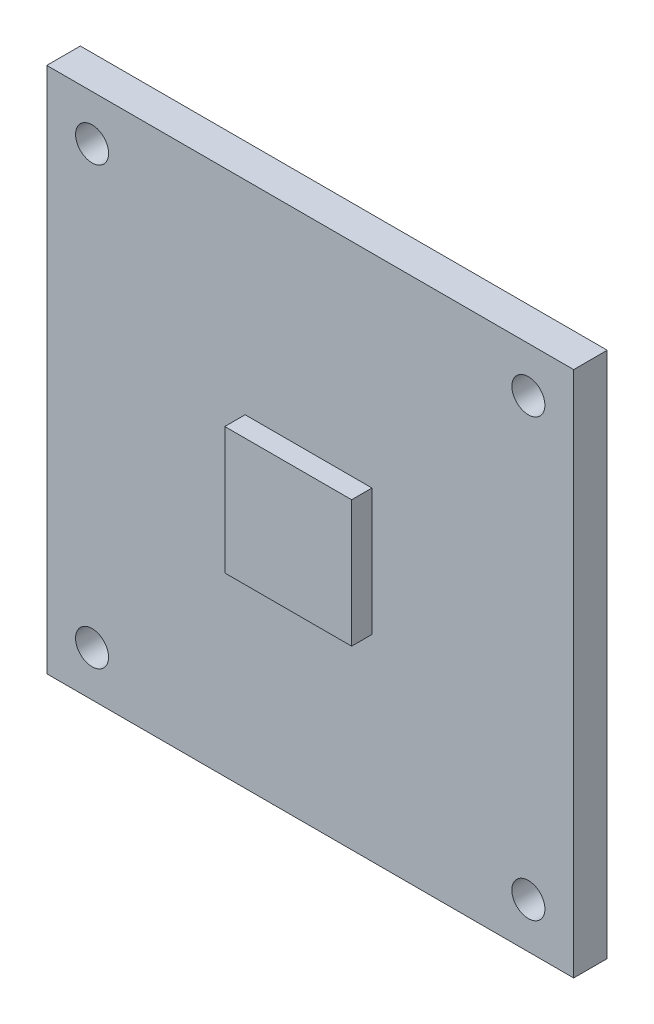
ISO-10303-21;
HEADER;
FILE_DESCRIPTION(('STEP AP214'),'2;1');
FILE_NAME('part.step','',(''),(''),'','','');
FILE_SCHEMA(('AUTOMOTIVE_DESIGN { 1 0 10303 214 1 1 1 1 }'));
ENDSEC;
DATA;
#1=APPLICATION_CONTEXT('core data for automotive mechanical design processes');
#2=APPLICATION_PROTOCOL_DEFINITION('international standard','automotive_design',2000,#1);
#3=PRODUCT_CONTEXT('',#1,'mechanical');
#4=PRODUCT('Part','Part','',(#3));
#5=PRODUCT_RELATED_PRODUCT_CATEGORY('part','',(#4));
#6=PRODUCT_DEFINITION_FORMATION('','',#4);
#7=PRODUCT_DEFINITION_CONTEXT('part definition',#1,'design');
#8=PRODUCT_DEFINITION('design','',#6,#7);
#9=PRODUCT_DEFINITION_SHAPE('','',#8);
#10=(LENGTH_UNIT() NAMED_UNIT(*) SI_UNIT(.MILLI.,.METRE.));
#11=(NAMED_UNIT(*) PLANE_ANGLE_UNIT() SI_UNIT($,.RADIAN.));
#12=(NAMED_UNIT(*) SI_UNIT($,.STERADIAN.) SOLID_ANGLE_UNIT());
#13=UNCERTAINTY_MEASURE_WITH_UNIT(LENGTH_MEASURE(1.E-05),#10,'distance_accuracy_value','');
#14=(GEOMETRIC_REPRESENTATION_CONTEXT(3) GLOBAL_UNCERTAINTY_ASSIGNED_CONTEXT((#13)) GLOBAL_UNIT_ASSIGNED_CONTEXT((#10,
#11,#12)) REPRESENTATION_CONTEXT('',''));
#15=CARTESIAN_POINT('',(0.,0.,0.));
#16=DIRECTION('',(0.,0.,1.));
#17=DIRECTION('',(1.,0.,0.));
#18=AXIS2_PLACEMENT_3D('',#15,#16,#17);
#19=CARTESIAN_POINT('',(0.,0.,0.));
#20=DIRECTION('',(0.,0.,1.));
#21=DIRECTION('',(1.,0.,0.));
#22=AXIS2_PLACEMENT_3D('',#19,#20,#21);
#23=PLANE('',#22);
#24=DIRECTION('',(0.,-1.,0.));
#25=VECTOR('',#24,1.);
#26=CARTESIAN_POINT('',(-3.42905,36.449,0.));
#27=LINE('',#26,#25);
#28=CARTESIAN_POINT('',(-3.42905,36.449,0.));
#29=VERTEX_POINT('',#28);
#30=CARTESIAN_POINT('',(-3.42905,-3.42905,0.));
#31=VERTEX_POINT('',#30);
#32=EDGE_CURVE('E164',#29,#31,#27,.T.);
#33=ORIENTED_EDGE('',*,*,#32,.T.);
#34=DIRECTION('',(1.,0.,0.));
#35=VECTOR('',#34,1.);
#36=CARTESIAN_POINT('',(-3.42905,-3.42905,0.));
#37=LINE('',#36,#35);
#38=CARTESIAN_POINT('',(36.449,-3.42905,0.));
#39=VERTEX_POINT('',#38);
#40=EDGE_CURVE('E177',#31,#39,#37,.T.);
#41=ORIENTED_EDGE('',*,*,#40,.T.);
#42=DIRECTION('',(0.,1.,0.));
#43=VECTOR('',#42,1.);
#44=CARTESIAN_POINT('',(36.449,36.449,0.));
#45=LINE('',#44,#43);
#46=CARTESIAN_POINT('',(36.449,36.449,0.));
#47=VERTEX_POINT('',#46);
#48=EDGE_CURVE('E180',#39,#47,#45,.T.);
#49=ORIENTED_EDGE('',*,*,#48,.T.);
#50=DIRECTION('',(-1.,0.,0.));
#51=VECTOR('',#50,1.);
#52=CARTESIAN_POINT('',(-3.42905,36.449,0.));
#53=LINE('',#52,#51);
#54=EDGE_CURVE('E168',#47,#29,#53,.T.);
#55=ORIENTED_EDGE('',*,*,#54,.T.);
#56=EDGE_LOOP('',(#33,#41,#49,#55));
#57=FACE_BOUND('',#56,.T.);
#58=CARTESIAN_POINT('',(0.,0.,0.));
#59=DIRECTION('',(0.,0.,1.));
#60=DIRECTION('',(1.,0.,0.));
#61=AXIS2_PLACEMENT_3D('',#58,#59,#60);
#62=CIRCLE('',#61,1.24999999999999);
#63=CARTESIAN_POINT('',(1.24999999999999,0.,0.));
#64=VERTEX_POINT('',#63);
#65=EDGE_CURVE('E158',#64,#64,#62,.T.);
#66=ORIENTED_EDGE('',*,*,#65,.F.);
#67=EDGE_LOOP('',(#66));
#68=FACE_BOUND('',#67,.T.);
#69=CARTESIAN_POINT('',(33.02,0.,0.));
#70=DIRECTION('',(0.,0.,1.));
#71=DIRECTION('',(1.,0.,0.));
#72=AXIS2_PLACEMENT_3D('',#69,#70,#71);
#73=CIRCLE('',#72,1.24999999999999);
#74=CARTESIAN_POINT('',(34.27,0.,0.));
#75=VERTEX_POINT('',#74);
#76=EDGE_CURVE('E152',#75,#75,#73,.T.);
#77=ORIENTED_EDGE('',*,*,#76,.F.);
#78=EDGE_LOOP('',(#77));
#79=FACE_BOUND('',#78,.T.);
#80=CARTESIAN_POINT('',(33.02,33.02,0.));
#81=DIRECTION('',(0.,0.,1.));
#82=DIRECTION('',(1.,0.,0.));
#83=AXIS2_PLACEMENT_3D('',#80,#81,#82);
#84=CIRCLE('',#83,1.24999999999999);
#85=CARTESIAN_POINT('',(34.27,33.02,0.));
#86=VERTEX_POINT('',#85);
#87=EDGE_CURVE('E146',#86,#86,#84,.T.);
#88=ORIENTED_EDGE('',*,*,#87,.F.);
#89=EDGE_LOOP('',(#88));
#90=FACE_BOUND('',#89,.T.);
#91=CARTESIAN_POINT('',(0.,33.02,0.));
#92=DIRECTION('',(0.,0.,1.));
#93=DIRECTION('',(1.,0.,0.));
#94=AXIS2_PLACEMENT_3D('',#91,#92,#93);
#95=CIRCLE('',#94,1.24999999999999);
#96=CARTESIAN_POINT('',(1.24999999999999,33.02,0.));
#97=VERTEX_POINT('',#96);
#98=EDGE_CURVE('E136',#97,#97,#95,.T.);
#99=ORIENTED_EDGE('',*,*,#98,.F.);
#100=EDGE_LOOP('',(#99));
#101=FACE_BOUND('',#100,.T.);
#102=DIRECTION('',(1.,0.,0.));
#103=VECTOR('',#102,1.);
#104=CARTESIAN_POINT('',(11.583,11.456,0.));
#105=LINE('',#104,#103);
#106=CARTESIAN_POINT('',(11.583,11.456,0.));
#107=VERTEX_POINT('',#106);
#108=CARTESIAN_POINT('',(21.183,11.456,0.));
#109=VERTEX_POINT('',#108);
#110=EDGE_CURVE('E361',#107,#109,#105,.T.);
#111=ORIENTED_EDGE('',*,*,#110,.F.);
#112=DIRECTION('',(0.,-1.,0.));
#113=VECTOR('',#112,1.);
#114=CARTESIAN_POINT('',(11.583,11.456,0.));
#115=LINE('',#114,#113);
#116=CARTESIAN_POINT('',(11.583,21.056,0.));
#117=VERTEX_POINT('',#116);
#118=EDGE_CURVE('E134',#117,#107,#115,.T.);
#119=ORIENTED_EDGE('',*,*,#118,.F.);
#120=DIRECTION('',(-1.,0.,0.));
#121=VECTOR('',#120,1.);
#122=CARTESIAN_POINT('',(11.583,21.056,0.));
#123=LINE('',#122,#121);
#124=CARTESIAN_POINT('',(21.183,21.056,0.));
#125=VERTEX_POINT('',#124);
#126=EDGE_CURVE('E130',#125,#117,#123,.T.);
#127=ORIENTED_EDGE('',*,*,#126,.F.);
#128=DIRECTION('',(0.,1.,0.));
#129=VECTOR('',#128,1.);
#130=CARTESIAN_POINT('',(21.183,11.456,0.));
#131=LINE('',#130,#129);
#132=EDGE_CURVE('E358',#109,#125,#131,.T.);
#133=ORIENTED_EDGE('',*,*,#132,.F.);
#134=EDGE_LOOP('',(#111,#119,#127,#133));
#135=FACE_BOUND('',#134,.T.);
#136=ADVANCED_FACE('F38',(#57,#68,#79,#90,#101,#135),#23,.T.);
#137=CARTESIAN_POINT('',(-3.42905,36.449,-2.54));
#138=DIRECTION('',(-1.,0.,0.));
#139=DIRECTION('',(0.,0.,1.));
#140=AXIS2_PLACEMENT_3D('',#137,#138,#139);
#141=PLANE('',#140);
#142=ORIENTED_EDGE('',*,*,#32,.F.);
#143=DIRECTION('',(0.,0.,1.));
#144=VECTOR('',#143,1.);
#145=CARTESIAN_POINT('',(-3.42905,36.449,-2.54));
#146=LINE('',#145,#144);
#147=CARTESIAN_POINT('',(-3.42905,36.449,-2.54));
#148=VERTEX_POINT('',#147);
#149=EDGE_CURVE('E11',#148,#29,#146,.T.);
#150=ORIENTED_EDGE('',*,*,#149,.F.);
#151=DIRECTION('',(0.,-1.,0.));
#152=VECTOR('',#151,1.);
#153=CARTESIAN_POINT('',(-3.42905,36.449,-2.54));
#154=LINE('',#153,#152);
#155=CARTESIAN_POINT('',(-3.42905,-3.42905,-2.54));
#156=VERTEX_POINT('',#155);
#157=EDGE_CURVE('E165',#148,#156,#154,.T.);
#158=ORIENTED_EDGE('',*,*,#157,.T.);
#159=DIRECTION('',(0.,0.,1.));
#160=VECTOR('',#159,1.);
#161=CARTESIAN_POINT('',(-3.42905,-3.42905,-2.54));
#162=LINE('',#161,#160);
#163=EDGE_CURVE('E42',#156,#31,#162,.T.);
#164=ORIENTED_EDGE('',*,*,#163,.T.);
#165=EDGE_LOOP('',(#142,#150,#158,#164));
#166=FACE_BOUND('',#165,.T.);
#167=ADVANCED_FACE('F40',(#166),#141,.T.);
#168=CARTESIAN_POINT('',(-3.42905,36.449,-2.54));
#169=DIRECTION('',(0.,1.,0.));
#170=DIRECTION('',(0.,0.,1.));
#171=AXIS2_PLACEMENT_3D('',#168,#169,#170);
#172=PLANE('',#171);
#173=ORIENTED_EDGE('',*,*,#54,.F.);
#174=DIRECTION('',(0.,0.,1.));
#175=VECTOR('',#174,1.);
#176=CARTESIAN_POINT('',(36.449,36.449,-2.54));
#177=LINE('',#176,#175);
#178=CARTESIAN_POINT('',(36.449,36.449,-2.54));
#179=VERTEX_POINT('',#178);
#180=EDGE_CURVE('E47',#179,#47,#177,.T.);
#181=ORIENTED_EDGE('',*,*,#180,.F.);
#182=DIRECTION('',(-1.,0.,0.));
#183=VECTOR('',#182,1.);
#184=CARTESIAN_POINT('',(-3.42905,36.449,-2.54));
#185=LINE('',#184,#183);
#186=EDGE_CURVE('E173',#179,#148,#185,.T.);
#187=ORIENTED_EDGE('',*,*,#186,.T.);
#188=ORIENTED_EDGE('',*,*,#149,.T.);
#189=EDGE_LOOP('',(#173,#181,#187,#188));
#190=FACE_BOUND('',#189,.T.);
#191=ADVANCED_FACE('F190',(#190),#172,.T.);
#192=CARTESIAN_POINT('',(36.449,36.449,-2.54));
#193=DIRECTION('',(1.,0.,0.));
#194=DIRECTION('',(0.,0.,-1.));
#195=AXIS2_PLACEMENT_3D('',#192,#193,#194);
#196=PLANE('',#195);
#197=ORIENTED_EDGE('',*,*,#48,.F.);
#198=DIRECTION('',(0.,0.,1.));
#199=VECTOR('',#198,1.);
#200=CARTESIAN_POINT('',(36.449,-3.42905,-2.54));
#201=LINE('',#200,#199);
#202=CARTESIAN_POINT('',(36.449,-3.42905,-2.54));
#203=VERTEX_POINT('',#202);
#204=EDGE_CURVE('E185',#203,#39,#201,.T.);
#205=ORIENTED_EDGE('',*,*,#204,.F.);
#206=DIRECTION('',(0.,1.,0.));
#207=VECTOR('',#206,1.);
#208=CARTESIAN_POINT('',(36.449,36.449,-2.54));
#209=LINE('',#208,#207);
#210=EDGE_CURVE('E170',#203,#179,#209,.T.);
#211=ORIENTED_EDGE('',*,*,#210,.T.);
#212=ORIENTED_EDGE('',*,*,#180,.T.);
#213=EDGE_LOOP('',(#197,#205,#211,#212));
#214=FACE_BOUND('',#213,.T.);
#215=ADVANCED_FACE('F194',(#214),#196,.T.);
#216=CARTESIAN_POINT('',(-3.42905,-3.42905,-2.54));
#217=DIRECTION('',(0.,-1.,0.));
#218=DIRECTION('',(0.,0.,-1.));
#219=AXIS2_PLACEMENT_3D('',#216,#217,#218);
#220=PLANE('',#219);
#221=ORIENTED_EDGE('',*,*,#40,.F.);
#222=ORIENTED_EDGE('',*,*,#163,.F.);
#223=DIRECTION('',(1.,0.,0.));
#224=VECTOR('',#223,1.);
#225=CARTESIAN_POINT('',(-3.42905,-3.42905,-2.54));
#226=LINE('',#225,#224);
#227=EDGE_CURVE('E167',#156,#203,#226,.T.);
#228=ORIENTED_EDGE('',*,*,#227,.T.);
#229=ORIENTED_EDGE('',*,*,#204,.T.);
#230=EDGE_LOOP('',(#221,#222,#228,#229));
#231=FACE_BOUND('',#230,.T.);
#232=ADVANCED_FACE('F187',(#231),#220,.T.);
#233=CARTESIAN_POINT('',(0.,0.,-2.54));
#234=DIRECTION('',(0.,0.,1.));
#235=DIRECTION('',(1.,0.,0.));
#236=AXIS2_PLACEMENT_3D('',#233,#234,#235);
#237=PLANE('',#236);
#238=CARTESIAN_POINT('',(0.,33.02,-2.54));
#239=DIRECTION('',(0.,0.,1.));
#240=DIRECTION('',(1.,0.,0.));
#241=AXIS2_PLACEMENT_3D('',#238,#239,#240);
#242=CIRCLE('',#241,1.25);
#243=CARTESIAN_POINT('',(1.25,33.02,-2.54));
#244=VERTEX_POINT('',#243);
#245=EDGE_CURVE('E139',#244,#244,#242,.T.);
#246=ORIENTED_EDGE('',*,*,#245,.T.);
#247=EDGE_LOOP('',(#246));
#248=FACE_BOUND('',#247,.T.);
#249=CARTESIAN_POINT('',(33.02,33.02,-2.54));
#250=DIRECTION('',(0.,0.,1.));
#251=DIRECTION('',(1.,0.,0.));
#252=AXIS2_PLACEMENT_3D('',#249,#250,#251);
#253=CIRCLE('',#252,1.25);
#254=CARTESIAN_POINT('',(34.27,33.02,-2.54));
#255=VERTEX_POINT('',#254);
#256=EDGE_CURVE('E149',#255,#255,#253,.T.);
#257=ORIENTED_EDGE('',*,*,#256,.T.);
#258=EDGE_LOOP('',(#257));
#259=FACE_BOUND('',#258,.T.);
#260=CARTESIAN_POINT('',(33.02,0.,-2.54));
#261=DIRECTION('',(0.,0.,1.));
#262=DIRECTION('',(1.,0.,0.));
#263=AXIS2_PLACEMENT_3D('',#260,#261,#262);
#264=CIRCLE('',#263,1.25);
#265=CARTESIAN_POINT('',(34.27,0.,-2.54));
#266=VERTEX_POINT('',#265);
#267=EDGE_CURVE('E155',#266,#266,#264,.T.);
#268=ORIENTED_EDGE('',*,*,#267,.T.);
#269=EDGE_LOOP('',(#268));
#270=FACE_BOUND('',#269,.T.);
#271=CARTESIAN_POINT('',(0.,0.,-2.54));
#272=DIRECTION('',(0.,0.,1.));
#273=DIRECTION('',(1.,0.,0.));
#274=AXIS2_PLACEMENT_3D('',#271,#272,#273);
#275=CIRCLE('',#274,1.25);
#276=CARTESIAN_POINT('',(1.25,0.,-2.54));
#277=VERTEX_POINT('',#276);
#278=EDGE_CURVE('E161',#277,#277,#275,.T.);
#279=ORIENTED_EDGE('',*,*,#278,.T.);
#280=EDGE_LOOP('',(#279));
#281=FACE_BOUND('',#280,.T.);
#282=ORIENTED_EDGE('',*,*,#157,.F.);
#283=ORIENTED_EDGE('',*,*,#186,.F.);
#284=ORIENTED_EDGE('',*,*,#210,.F.);
#285=ORIENTED_EDGE('',*,*,#227,.F.);
#286=EDGE_LOOP('',(#282,#283,#284,#285));
#287=FACE_BOUND('',#286,.T.);
#288=ADVANCED_FACE('F196',(#248,#259,#270,#281,#287),#237,.F.);
#289=CARTESIAN_POINT('',(0.,0.,0.));
#290=DIRECTION('',(0.,0.,1.));
#291=DIRECTION('',(1.,0.,0.));
#292=AXIS2_PLACEMENT_3D('',#289,#290,#291);
#293=CYLINDRICAL_SURFACE('',#292,1.24999999999999);
#294=ORIENTED_EDGE('',*,*,#278,.F.);
#295=EDGE_LOOP('',(#294));
#296=FACE_BOUND('',#295,.T.);
#297=ORIENTED_EDGE('',*,*,#65,.T.);
#298=EDGE_LOOP('',(#297));
#299=FACE_BOUND('',#298,.T.);
#300=ADVANCED_FACE('F198',(#296,#299),#293,.F.);
#301=CARTESIAN_POINT('',(33.02,0.,0.));
#302=DIRECTION('',(0.,0.,1.));
#303=DIRECTION('',(1.,0.,0.));
#304=AXIS2_PLACEMENT_3D('',#301,#302,#303);
#305=CYLINDRICAL_SURFACE('',#304,1.24999999999999);
#306=ORIENTED_EDGE('',*,*,#267,.F.);
#307=EDGE_LOOP('',(#306));
#308=FACE_BOUND('',#307,.T.);
#309=ORIENTED_EDGE('',*,*,#76,.T.);
#310=EDGE_LOOP('',(#309));
#311=FACE_BOUND('',#310,.T.);
#312=ADVANCED_FACE('F205',(#308,#311),#305,.F.);
#313=CARTESIAN_POINT('',(33.02,33.02,0.));
#314=DIRECTION('',(0.,0.,1.));
#315=DIRECTION('',(1.,0.,0.));
#316=AXIS2_PLACEMENT_3D('',#313,#314,#315);
#317=CYLINDRICAL_SURFACE('',#316,1.24999999999999);
#318=ORIENTED_EDGE('',*,*,#256,.F.);
#319=EDGE_LOOP('',(#318));
#320=FACE_BOUND('',#319,.T.);
#321=ORIENTED_EDGE('',*,*,#87,.T.);
#322=EDGE_LOOP('',(#321));
#323=FACE_BOUND('',#322,.T.);
#324=ADVANCED_FACE('F270',(#320,#323),#317,.F.);
#325=CARTESIAN_POINT('',(0.,33.02,0.));
#326=DIRECTION('',(0.,0.,1.));
#327=DIRECTION('',(1.,0.,0.));
#328=AXIS2_PLACEMENT_3D('',#325,#326,#327);
#329=CYLINDRICAL_SURFACE('',#328,1.24999999999999);
#330=ORIENTED_EDGE('',*,*,#245,.F.);
#331=EDGE_LOOP('',(#330));
#332=FACE_BOUND('',#331,.T.);
#333=ORIENTED_EDGE('',*,*,#98,.T.);
#334=EDGE_LOOP('',(#333));
#335=FACE_BOUND('',#334,.T.);
#336=ADVANCED_FACE('F280',(#332,#335),#329,.F.);
#337=CARTESIAN_POINT('',(11.583,11.456,1.54));
#338=DIRECTION('',(1.,0.,0.));
#339=DIRECTION('',(0.,0.,-1.));
#340=AXIS2_PLACEMENT_3D('',#337,#338,#339);
#341=PLANE('',#340);
#342=ORIENTED_EDGE('',*,*,#118,.T.);
#343=DIRECTION('',(0.,0.,-1.));
#344=VECTOR('',#343,1.);
#345=CARTESIAN_POINT('',(11.583,11.456,1.54));
#346=LINE('',#345,#344);
#347=CARTESIAN_POINT('',(11.583,11.456,1.54));
#348=VERTEX_POINT('',#347);
#349=EDGE_CURVE('E115',#348,#107,#346,.T.);
#350=ORIENTED_EDGE('',*,*,#349,.F.);
#351=DIRECTION('',(0.,-1.,0.));
#352=VECTOR('',#351,1.);
#353=CARTESIAN_POINT('',(11.583,11.456,1.54));
#354=LINE('',#353,#352);
#355=CARTESIAN_POINT('',(11.583,21.056,1.54));
#356=VERTEX_POINT('',#355);
#357=EDGE_CURVE('E122',#356,#348,#354,.T.);
#358=ORIENTED_EDGE('',*,*,#357,.F.);
#359=DIRECTION('',(0.,0.,-1.));
#360=VECTOR('',#359,1.);
#361=CARTESIAN_POINT('',(11.583,21.056,1.54));
#362=LINE('',#361,#360);
#363=EDGE_CURVE('E355',#356,#117,#362,.T.);
#364=ORIENTED_EDGE('',*,*,#363,.T.);
#365=EDGE_LOOP('',(#342,#350,#358,#364));
#366=FACE_BOUND('',#365,.T.);
#367=ADVANCED_FACE('F132',(#366),#341,.F.);
#368=CARTESIAN_POINT('',(11.583,11.456,1.54));
#369=DIRECTION('',(0.,1.,0.));
#370=DIRECTION('',(-1.,0.,0.));
#371=AXIS2_PLACEMENT_3D('',#368,#369,#370);
#372=PLANE('',#371);
#373=ORIENTED_EDGE('',*,*,#110,.T.);
#374=DIRECTION('',(0.,0.,-1.));
#375=VECTOR('',#374,1.);
#376=CARTESIAN_POINT('',(21.183,11.456,1.54));
#377=LINE('',#376,#375);
#378=CARTESIAN_POINT('',(21.183,11.456,1.54));
#379=VERTEX_POINT('',#378);
#380=EDGE_CURVE('E118',#379,#109,#377,.T.);
#381=ORIENTED_EDGE('',*,*,#380,.F.);
#382=DIRECTION('',(1.,0.,0.));
#383=VECTOR('',#382,1.);
#384=CARTESIAN_POINT('',(11.583,11.456,1.54));
#385=LINE('',#384,#383);
#386=EDGE_CURVE('E111',#348,#379,#385,.T.);
#387=ORIENTED_EDGE('',*,*,#386,.F.);
#388=ORIENTED_EDGE('',*,*,#349,.T.);
#389=EDGE_LOOP('',(#373,#381,#387,#388));
#390=FACE_BOUND('',#389,.T.);
#391=ADVANCED_FACE('F113',(#390),#372,.F.);
#392=CARTESIAN_POINT('',(21.183,11.456,1.54));
#393=DIRECTION('',(-1.,0.,0.));
#394=DIRECTION('',(0.,0.,1.));
#395=AXIS2_PLACEMENT_3D('',#392,#393,#394);
#396=PLANE('',#395);
#397=ORIENTED_EDGE('',*,*,#132,.T.);
#398=DIRECTION('',(0.,0.,-1.));
#399=VECTOR('',#398,1.);
#400=CARTESIAN_POINT('',(21.183,21.056,1.54));
#401=LINE('',#400,#399);
#402=CARTESIAN_POINT('',(21.183,21.056,1.54));
#403=VERTEX_POINT('',#402);
#404=EDGE_CURVE('E55',#403,#125,#401,.T.);
#405=ORIENTED_EDGE('',*,*,#404,.F.);
#406=DIRECTION('',(0.,1.,0.));
#407=VECTOR('',#406,1.);
#408=CARTESIAN_POINT('',(21.183,11.456,1.54));
#409=LINE('',#408,#407);
#410=EDGE_CURVE('E121',#379,#403,#409,.T.);
#411=ORIENTED_EDGE('',*,*,#410,.F.);
#412=ORIENTED_EDGE('',*,*,#380,.T.);
#413=EDGE_LOOP('',(#397,#405,#411,#412));
#414=FACE_BOUND('',#413,.T.);
#415=ADVANCED_FACE('F312',(#414),#396,.F.);
#416=CARTESIAN_POINT('',(11.583,21.056,1.54));
#417=DIRECTION('',(0.,-1.,0.));
#418=DIRECTION('',(0.,0.,-1.));
#419=AXIS2_PLACEMENT_3D('',#416,#417,#418);
#420=PLANE('',#419);
#421=ORIENTED_EDGE('',*,*,#126,.T.);
#422=ORIENTED_EDGE('',*,*,#363,.F.);
#423=DIRECTION('',(-1.,0.,0.));
#424=VECTOR('',#423,1.);
#425=CARTESIAN_POINT('',(11.583,21.056,1.54));
#426=LINE('',#425,#424);
#427=EDGE_CURVE('E126',#403,#356,#426,.T.);
#428=ORIENTED_EDGE('',*,*,#427,.F.);
#429=ORIENTED_EDGE('',*,*,#404,.T.);
#430=EDGE_LOOP('',(#421,#422,#428,#429));
#431=FACE_BOUND('',#430,.T.);
#432=ADVANCED_FACE('F320',(#431),#420,.F.);
#433=CARTESIAN_POINT('',(0.,0.,1.54));
#434=DIRECTION('',(0.,0.,-1.));
#435=DIRECTION('',(-1.,0.,0.));
#436=AXIS2_PLACEMENT_3D('',#433,#434,#435);
#437=PLANE('',#436);
#438=ORIENTED_EDGE('',*,*,#357,.T.);
#439=ORIENTED_EDGE('',*,*,#386,.T.);
#440=ORIENTED_EDGE('',*,*,#410,.T.);
#441=ORIENTED_EDGE('',*,*,#427,.T.);
#442=EDGE_LOOP('',(#438,#439,#440,#441));
#443=FACE_BOUND('',#442,.T.);
#444=ADVANCED_FACE('F125',(#443),#437,.F.);
#445=CLOSED_SHELL('',(#136,#167,#191,#215,#232,#288,#300,#312,#324,#336,#367,#391,#415,#432,#444));
#446=MANIFOLD_SOLID_BREP('B2',#445);
#447=ADVANCED_BREP_SHAPE_REPRESENTATION('',(#18,#446),#14);
#448=SHAPE_DEFINITION_REPRESENTATION(#9,#447);
ENDSEC;
END-ISO-10303-21;
